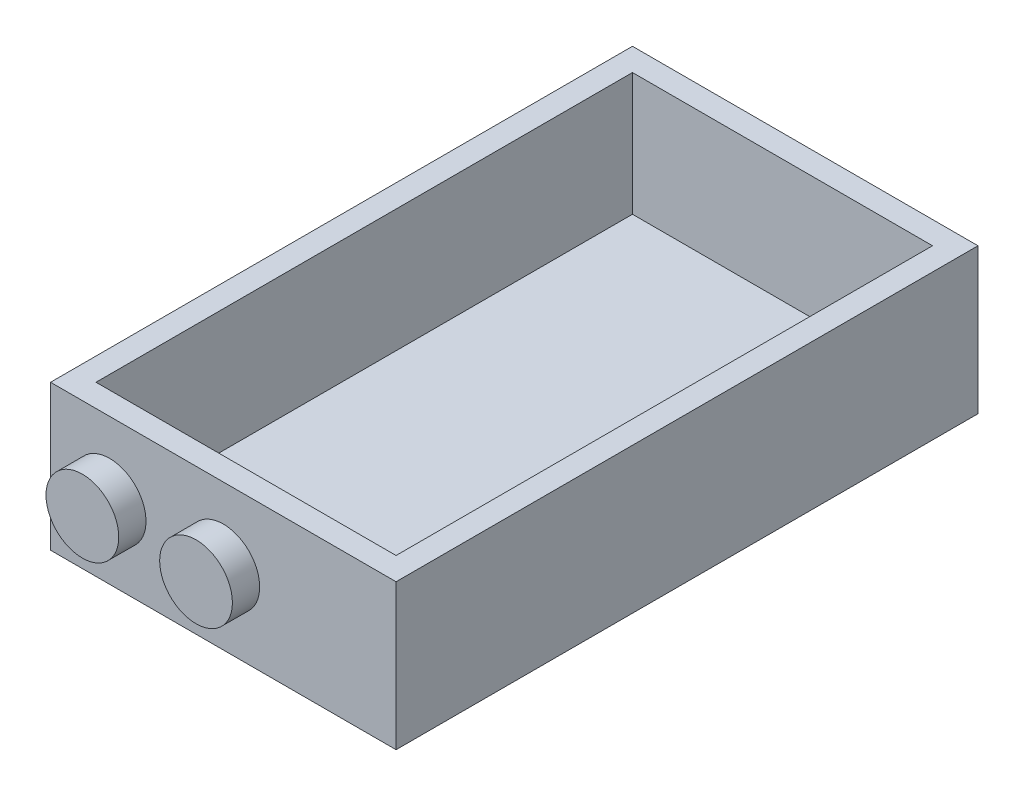
ISO-10303-21;
HEADER;
FILE_DESCRIPTION(('STEP AP214'),'2;1');
FILE_NAME('part.step','',(''),(''),'','','');
FILE_SCHEMA(('AUTOMOTIVE_DESIGN { 1 0 10303 214 1 1 1 1 }'));
ENDSEC;
DATA;
#1=APPLICATION_CONTEXT('core data for automotive mechanical design processes');
#2=APPLICATION_PROTOCOL_DEFINITION('international standard','automotive_design',2000,#1);
#3=PRODUCT_CONTEXT('',#1,'mechanical');
#4=PRODUCT('Part','Part','',(#3));
#5=PRODUCT_RELATED_PRODUCT_CATEGORY('part','',(#4));
#6=PRODUCT_DEFINITION_FORMATION('','',#4);
#7=PRODUCT_DEFINITION_CONTEXT('part definition',#1,'design');
#8=PRODUCT_DEFINITION('design','',#6,#7);
#9=PRODUCT_DEFINITION_SHAPE('','',#8);
#10=(LENGTH_UNIT() NAMED_UNIT(*) SI_UNIT(.MILLI.,.METRE.));
#11=(NAMED_UNIT(*) PLANE_ANGLE_UNIT() SI_UNIT($,.RADIAN.));
#12=(NAMED_UNIT(*) SI_UNIT($,.STERADIAN.) SOLID_ANGLE_UNIT());
#13=UNCERTAINTY_MEASURE_WITH_UNIT(LENGTH_MEASURE(1.E-05),#10,'distance_accuracy_value','');
#14=(GEOMETRIC_REPRESENTATION_CONTEXT(3) GLOBAL_UNCERTAINTY_ASSIGNED_CONTEXT((#13)) GLOBAL_UNIT_ASSIGNED_CONTEXT((#10,
#11,#12)) REPRESENTATION_CONTEXT('',''));
#15=CARTESIAN_POINT('',(0.,0.,0.));
#16=DIRECTION('',(0.,0.,1.));
#17=DIRECTION('',(1.,0.,0.));
#18=AXIS2_PLACEMENT_3D('',#15,#16,#17);
#19=CARTESIAN_POINT('',(0.,16.,0.));
#20=DIRECTION('',(1.,0.,0.));
#21=DIRECTION('',(0.,0.,-1.));
#22=AXIS2_PLACEMENT_3D('',#19,#20,#21);
#23=PLANE('',#22);
#24=DIRECTION('',(0.,0.,1.));
#25=VECTOR('',#24,1.);
#26=CARTESIAN_POINT('',(0.,0.,0.));
#27=LINE('',#26,#25);
#28=CARTESIAN_POINT('',(0.,0.,0.));
#29=VERTEX_POINT('',#28);
#30=CARTESIAN_POINT('',(0.,0.,64.));
#31=VERTEX_POINT('',#30);
#32=EDGE_CURVE('E154',#29,#31,#27,.T.);
#33=ORIENTED_EDGE('',*,*,#32,.T.);
#34=DIRECTION('',(0.,-1.,0.));
#35=VECTOR('',#34,1.);
#36=CARTESIAN_POINT('',(0.,16.,64.));
#37=LINE('',#36,#35);
#38=CARTESIAN_POINT('',(0.,16.,64.));
#39=VERTEX_POINT('',#38);
#40=EDGE_CURVE('E175',#39,#31,#37,.T.);
#41=ORIENTED_EDGE('',*,*,#40,.F.);
#42=DIRECTION('',(0.,0.,1.));
#43=VECTOR('',#42,1.);
#44=CARTESIAN_POINT('',(0.,16.,0.));
#45=LINE('',#44,#43);
#46=CARTESIAN_POINT('',(0.,16.,0.));
#47=VERTEX_POINT('',#46);
#48=EDGE_CURVE('E155',#47,#39,#45,.T.);
#49=ORIENTED_EDGE('',*,*,#48,.F.);
#50=DIRECTION('',(0.,-1.,0.));
#51=VECTOR('',#50,1.);
#52=CARTESIAN_POINT('',(0.,16.,0.));
#53=LINE('',#52,#51);
#54=EDGE_CURVE('E161',#47,#29,#53,.T.);
#55=ORIENTED_EDGE('',*,*,#54,.T.);
#56=EDGE_LOOP('',(#33,#41,#49,#55));
#57=FACE_BOUND('',#56,.T.);
#58=ADVANCED_FACE('F33',(#57),#23,.F.);
#59=CARTESIAN_POINT('',(0.,16.,64.));
#60=DIRECTION('',(0.,0.,-1.));
#61=DIRECTION('',(-1.,0.,0.));
#62=AXIS2_PLACEMENT_3D('',#59,#60,#61);
#63=PLANE('',#62);
#64=CARTESIAN_POINT('',(6.50000000000002,8.,64.));
#65=DIRECTION('',(0.,0.,-1.));
#66=DIRECTION('',(-1.,0.,0.));
#67=AXIS2_PLACEMENT_3D('',#64,#65,#66);
#68=CIRCLE('',#67,4.);
#69=CARTESIAN_POINT('',(2.50000000000002,8.,64.));
#70=VERTEX_POINT('',#69);
#71=EDGE_CURVE('E11',#70,#70,#68,.F.);
#72=ORIENTED_EDGE('',*,*,#71,.F.);
#73=EDGE_LOOP('',(#72));
#74=FACE_BOUND('',#73,.T.);
#75=CARTESIAN_POINT('',(19.,8.,64.));
#76=DIRECTION('',(0.,0.,-1.));
#77=DIRECTION('',(-1.,0.,0.));
#78=AXIS2_PLACEMENT_3D('',#75,#76,#77);
#79=CIRCLE('',#78,4.);
#80=CARTESIAN_POINT('',(15.,8.,64.));
#81=VERTEX_POINT('',#80);
#82=EDGE_CURVE('E40',#81,#81,#79,.F.);
#83=ORIENTED_EDGE('',*,*,#82,.F.);
#84=EDGE_LOOP('',(#83));
#85=FACE_BOUND('',#84,.T.);
#86=DIRECTION('',(1.,0.,0.));
#87=VECTOR('',#86,1.);
#88=CARTESIAN_POINT('',(0.,0.,64.));
#89=LINE('',#88,#87);
#90=CARTESIAN_POINT('',(38.,0.,64.));
#91=VERTEX_POINT('',#90);
#92=EDGE_CURVE('E164',#31,#91,#89,.T.);
#93=ORIENTED_EDGE('',*,*,#92,.T.);
#94=DIRECTION('',(0.,-1.,0.));
#95=VECTOR('',#94,1.);
#96=CARTESIAN_POINT('',(38.,16.,64.));
#97=LINE('',#96,#95);
#98=CARTESIAN_POINT('',(38.,16.,64.));
#99=VERTEX_POINT('',#98);
#100=EDGE_CURVE('E172',#99,#91,#97,.T.);
#101=ORIENTED_EDGE('',*,*,#100,.F.);
#102=DIRECTION('',(1.,0.,0.));
#103=VECTOR('',#102,1.);
#104=CARTESIAN_POINT('',(0.,16.,64.));
#105=LINE('',#104,#103);
#106=EDGE_CURVE('E85',#39,#99,#105,.T.);
#107=ORIENTED_EDGE('',*,*,#106,.F.);
#108=ORIENTED_EDGE('',*,*,#40,.T.);
#109=EDGE_LOOP('',(#93,#101,#107,#108));
#110=FACE_BOUND('',#109,.T.);
#111=ADVANCED_FACE('F181',(#74,#85,#110),#63,.F.);
#112=CARTESIAN_POINT('',(38.,16.,0.));
#113=DIRECTION('',(-1.,0.,0.));
#114=DIRECTION('',(0.,0.,1.));
#115=AXIS2_PLACEMENT_3D('',#112,#113,#114);
#116=PLANE('',#115);
#117=DIRECTION('',(0.,0.,-1.));
#118=VECTOR('',#117,1.);
#119=CARTESIAN_POINT('',(38.,0.,0.));
#120=LINE('',#119,#118);
#121=CARTESIAN_POINT('',(38.,0.,0.));
#122=VERTEX_POINT('',#121);
#123=EDGE_CURVE('E166',#91,#122,#120,.T.);
#124=ORIENTED_EDGE('',*,*,#123,.T.);
#125=DIRECTION('',(0.,-1.,0.));
#126=VECTOR('',#125,1.);
#127=CARTESIAN_POINT('',(38.,16.,0.));
#128=LINE('',#127,#126);
#129=CARTESIAN_POINT('',(38.,16.,0.));
#130=VERTEX_POINT('',#129);
#131=EDGE_CURVE('E170',#130,#122,#128,.T.);
#132=ORIENTED_EDGE('',*,*,#131,.F.);
#133=DIRECTION('',(0.,0.,-1.));
#134=VECTOR('',#133,1.);
#135=CARTESIAN_POINT('',(38.,16.,0.));
#136=LINE('',#135,#134);
#137=EDGE_CURVE('E158',#99,#130,#136,.T.);
#138=ORIENTED_EDGE('',*,*,#137,.F.);
#139=ORIENTED_EDGE('',*,*,#100,.T.);
#140=EDGE_LOOP('',(#124,#132,#138,#139));
#141=FACE_BOUND('',#140,.T.);
#142=ADVANCED_FACE('F183',(#141),#116,.F.);
#143=CARTESIAN_POINT('',(0.,16.,0.));
#144=DIRECTION('',(0.,0.,1.));
#145=DIRECTION('',(1.,0.,0.));
#146=AXIS2_PLACEMENT_3D('',#143,#144,#145);
#147=PLANE('',#146);
#148=DIRECTION('',(-1.,0.,0.));
#149=VECTOR('',#148,1.);
#150=CARTESIAN_POINT('',(0.,0.,0.));
#151=LINE('',#150,#149);
#152=EDGE_CURVE('E77',#122,#29,#151,.T.);
#153=ORIENTED_EDGE('',*,*,#152,.T.);
#154=ORIENTED_EDGE('',*,*,#54,.F.);
#155=DIRECTION('',(-1.,0.,0.));
#156=VECTOR('',#155,1.);
#157=CARTESIAN_POINT('',(0.,16.,0.));
#158=LINE('',#157,#156);
#159=EDGE_CURVE('E56',#130,#47,#158,.T.);
#160=ORIENTED_EDGE('',*,*,#159,.F.);
#161=ORIENTED_EDGE('',*,*,#131,.T.);
#162=EDGE_LOOP('',(#153,#154,#160,#161));
#163=FACE_BOUND('',#162,.T.);
#164=ADVANCED_FACE('F195',(#163),#147,.F.);
#165=CARTESIAN_POINT('',(0.,16.,0.));
#166=DIRECTION('',(0.,1.,0.));
#167=DIRECTION('',(0.,0.,1.));
#168=AXIS2_PLACEMENT_3D('',#165,#166,#167);
#169=PLANE('',#168);
#170=DIRECTION('',(0.,0.,1.));
#171=VECTOR('',#170,1.);
#172=CARTESIAN_POINT('',(2.5,16.,0.));
#173=LINE('',#172,#171);
#174=CARTESIAN_POINT('',(2.5,16.,2.5));
#175=VERTEX_POINT('',#174);
#176=CARTESIAN_POINT('',(2.50000000000002,16.,61.5));
#177=VERTEX_POINT('',#176);
#178=EDGE_CURVE('E130',#175,#177,#173,.T.);
#179=ORIENTED_EDGE('',*,*,#178,.F.);
#180=DIRECTION('',(-1.,0.,0.));
#181=VECTOR('',#180,1.);
#182=CARTESIAN_POINT('',(0.,16.,2.5));
#183=LINE('',#182,#181);
#184=CARTESIAN_POINT('',(35.5,16.,2.5));
#185=VERTEX_POINT('',#184);
#186=EDGE_CURVE('E145',#185,#175,#183,.T.);
#187=ORIENTED_EDGE('',*,*,#186,.F.);
#188=DIRECTION('',(0.,0.,-1.));
#189=VECTOR('',#188,1.);
#190=CARTESIAN_POINT('',(35.5,16.,0.));
#191=LINE('',#190,#189);
#192=CARTESIAN_POINT('',(35.5,16.,61.5));
#193=VERTEX_POINT('',#192);
#194=EDGE_CURVE('E143',#193,#185,#191,.T.);
#195=ORIENTED_EDGE('',*,*,#194,.F.);
#196=DIRECTION('',(1.,0.,0.));
#197=VECTOR('',#196,1.);
#198=CARTESIAN_POINT('',(0.,16.,61.5));
#199=LINE('',#198,#197);
#200=EDGE_CURVE('E122',#177,#193,#199,.T.);
#201=ORIENTED_EDGE('',*,*,#200,.F.);
#202=EDGE_LOOP('',(#179,#187,#195,#201));
#203=FACE_BOUND('',#202,.T.);
#204=ORIENTED_EDGE('',*,*,#48,.T.);
#205=ORIENTED_EDGE('',*,*,#106,.T.);
#206=ORIENTED_EDGE('',*,*,#137,.T.);
#207=ORIENTED_EDGE('',*,*,#159,.T.);
#208=EDGE_LOOP('',(#204,#205,#206,#207));
#209=FACE_BOUND('',#208,.T.);
#210=ADVANCED_FACE('F197',(#203,#209),#169,.T.);
#211=CARTESIAN_POINT('',(0.,0.,0.));
#212=DIRECTION('',(0.,1.,0.));
#213=DIRECTION('',(0.,0.,1.));
#214=AXIS2_PLACEMENT_3D('',#211,#212,#213);
#215=PLANE('',#214);
#216=ORIENTED_EDGE('',*,*,#32,.F.);
#217=ORIENTED_EDGE('',*,*,#152,.F.);
#218=ORIENTED_EDGE('',*,*,#123,.F.);
#219=ORIENTED_EDGE('',*,*,#92,.F.);
#220=EDGE_LOOP('',(#216,#217,#218,#219));
#221=FACE_BOUND('',#220,.T.);
#222=ADVANCED_FACE('F192',(#221),#215,.F.);
#223=CARTESIAN_POINT('',(19.,8.,67.));
#224=DIRECTION('',(0.,0.,-1.));
#225=DIRECTION('',(-1.,0.,0.));
#226=AXIS2_PLACEMENT_3D('',#223,#224,#225);
#227=CYLINDRICAL_SURFACE('',#226,4.);
#228=CARTESIAN_POINT('',(19.,8.,67.));
#229=DIRECTION('',(0.,0.,1.));
#230=DIRECTION('',(1.,0.,0.));
#231=AXIS2_PLACEMENT_3D('',#228,#229,#230);
#232=CIRCLE('',#231,4.);
#233=CARTESIAN_POINT('',(23.,8.,67.));
#234=VERTEX_POINT('',#233);
#235=EDGE_CURVE('E150',#234,#234,#232,.T.);
#236=ORIENTED_EDGE('',*,*,#235,.F.);
#237=EDGE_LOOP('',(#236));
#238=FACE_BOUND('',#237,.T.);
#239=ORIENTED_EDGE('',*,*,#82,.T.);
#240=EDGE_LOOP('',(#239));
#241=FACE_BOUND('',#240,.T.);
#242=ADVANCED_FACE('F179',(#238,#241),#227,.T.);
#243=CARTESIAN_POINT('',(19.,8.,67.));
#244=DIRECTION('',(0.,0.,1.));
#245=DIRECTION('',(1.,0.,0.));
#246=AXIS2_PLACEMENT_3D('',#243,#244,#245);
#247=PLANE('',#246);
#248=ORIENTED_EDGE('',*,*,#235,.T.);
#249=EDGE_LOOP('',(#248));
#250=FACE_BOUND('',#249,.T.);
#251=ADVANCED_FACE('F241',(#250),#247,.T.);
#252=CARTESIAN_POINT('',(6.50000000000002,8.,67.));
#253=DIRECTION('',(0.,0.,-1.));
#254=DIRECTION('',(-1.,0.,0.));
#255=AXIS2_PLACEMENT_3D('',#252,#253,#254);
#256=CYLINDRICAL_SURFACE('',#255,4.);
#257=CARTESIAN_POINT('',(6.50000000000002,8.,67.));
#258=DIRECTION('',(0.,0.,1.));
#259=DIRECTION('',(1.,0.,0.));
#260=AXIS2_PLACEMENT_3D('',#257,#258,#259);
#261=CIRCLE('',#260,4.);
#262=CARTESIAN_POINT('',(10.5,8.,67.));
#263=VERTEX_POINT('',#262);
#264=EDGE_CURVE('E147',#263,#263,#261,.T.);
#265=ORIENTED_EDGE('',*,*,#264,.F.);
#266=EDGE_LOOP('',(#265));
#267=FACE_BOUND('',#266,.T.);
#268=ORIENTED_EDGE('',*,*,#71,.T.);
#269=EDGE_LOOP('',(#268));
#270=FACE_BOUND('',#269,.T.);
#271=ADVANCED_FACE('F248',(#267,#270),#256,.T.);
#272=CARTESIAN_POINT('',(6.50000000000002,8.,67.));
#273=DIRECTION('',(0.,0.,1.));
#274=DIRECTION('',(1.,0.,0.));
#275=AXIS2_PLACEMENT_3D('',#272,#273,#274);
#276=PLANE('',#275);
#277=ORIENTED_EDGE('',*,*,#264,.T.);
#278=EDGE_LOOP('',(#277));
#279=FACE_BOUND('',#278,.T.);
#280=ADVANCED_FACE('F256',(#279),#276,.T.);
#281=CARTESIAN_POINT('',(2.5,16.,0.));
#282=DIRECTION('',(1.,0.,0.));
#283=DIRECTION('',(0.,0.,-1.));
#284=AXIS2_PLACEMENT_3D('',#281,#282,#283);
#285=PLANE('',#284);
#286=DIRECTION('',(0.,0.,1.));
#287=VECTOR('',#286,1.);
#288=CARTESIAN_POINT('',(2.5,2.5,0.));
#289=LINE('',#288,#287);
#290=CARTESIAN_POINT('',(2.5,2.5,2.5));
#291=VERTEX_POINT('',#290);
#292=CARTESIAN_POINT('',(2.50000000000002,2.5,61.5));
#293=VERTEX_POINT('',#292);
#294=EDGE_CURVE('E113',#291,#293,#289,.T.);
#295=ORIENTED_EDGE('',*,*,#294,.F.);
#296=DIRECTION('',(0.,-1.,0.));
#297=VECTOR('',#296,1.);
#298=CARTESIAN_POINT('',(2.5,16.,2.5));
#299=LINE('',#298,#297);
#300=EDGE_CURVE('E133',#175,#291,#299,.T.);
#301=ORIENTED_EDGE('',*,*,#300,.F.);
#302=ORIENTED_EDGE('',*,*,#178,.T.);
#303=DIRECTION('',(0.,-1.,0.));
#304=VECTOR('',#303,1.);
#305=CARTESIAN_POINT('',(2.50000000000002,16.,61.5));
#306=LINE('',#305,#304);
#307=EDGE_CURVE('E125',#177,#293,#306,.T.);
#308=ORIENTED_EDGE('',*,*,#307,.T.);
#309=EDGE_LOOP('',(#295,#301,#302,#308));
#310=FACE_BOUND('',#309,.T.);
#311=ADVANCED_FACE('F264',(#310),#285,.T.);
#312=CARTESIAN_POINT('',(0.,16.,61.5));
#313=DIRECTION('',(0.,0.,-1.));
#314=DIRECTION('',(-1.,0.,0.));
#315=AXIS2_PLACEMENT_3D('',#312,#313,#314);
#316=PLANE('',#315);
#317=CARTESIAN_POINT('',(6.50000000000002,8.,61.5));
#318=DIRECTION('',(0.,0.,-1.));
#319=DIRECTION('',(-1.,0.,0.));
#320=AXIS2_PLACEMENT_3D('',#317,#318,#319);
#321=CIRCLE('',#320,1.5);
#322=CARTESIAN_POINT('',(5.00000000000002,8.,61.5));
#323=VERTEX_POINT('',#322);
#324=EDGE_CURVE('E151',#323,#323,#321,.F.);
#325=ORIENTED_EDGE('',*,*,#324,.T.);
#326=EDGE_LOOP('',(#325));
#327=FACE_BOUND('',#326,.T.);
#328=CARTESIAN_POINT('',(19.,8.,61.5));
#329=DIRECTION('',(0.,0.,-1.));
#330=DIRECTION('',(-1.,0.,0.));
#331=AXIS2_PLACEMENT_3D('',#328,#329,#330);
#332=CIRCLE('',#331,1.5);
#333=CARTESIAN_POINT('',(17.5,8.,61.5));
#334=VERTEX_POINT('',#333);
#335=EDGE_CURVE('E363',#334,#334,#332,.F.);
#336=ORIENTED_EDGE('',*,*,#335,.T.);
#337=EDGE_LOOP('',(#336));
#338=FACE_BOUND('',#337,.T.);
#339=DIRECTION('',(1.,0.,0.));
#340=VECTOR('',#339,1.);
#341=CARTESIAN_POINT('',(0.,2.5,61.5));
#342=LINE('',#341,#340);
#343=CARTESIAN_POINT('',(35.5,2.5,61.5));
#344=VERTEX_POINT('',#343);
#345=EDGE_CURVE('E107',#293,#344,#342,.T.);
#346=ORIENTED_EDGE('',*,*,#345,.F.);
#347=ORIENTED_EDGE('',*,*,#307,.F.);
#348=ORIENTED_EDGE('',*,*,#200,.T.);
#349=DIRECTION('',(0.,-1.,0.));
#350=VECTOR('',#349,1.);
#351=CARTESIAN_POINT('',(35.5,16.,61.5));
#352=LINE('',#351,#350);
#353=EDGE_CURVE('E119',#193,#344,#352,.T.);
#354=ORIENTED_EDGE('',*,*,#353,.T.);
#355=EDGE_LOOP('',(#346,#347,#348,#354));
#356=FACE_BOUND('',#355,.T.);
#357=ADVANCED_FACE('F120',(#327,#338,#356),#316,.T.);
#358=CARTESIAN_POINT('',(35.5,16.,0.));
#359=DIRECTION('',(-1.,0.,0.));
#360=DIRECTION('',(0.,0.,1.));
#361=AXIS2_PLACEMENT_3D('',#358,#359,#360);
#362=PLANE('',#361);
#363=DIRECTION('',(0.,0.,-1.));
#364=VECTOR('',#363,1.);
#365=CARTESIAN_POINT('',(35.5,2.5,0.));
#366=LINE('',#365,#364);
#367=CARTESIAN_POINT('',(35.5,2.5,2.5));
#368=VERTEX_POINT('',#367);
#369=EDGE_CURVE('E111',#344,#368,#366,.T.);
#370=ORIENTED_EDGE('',*,*,#369,.F.);
#371=ORIENTED_EDGE('',*,*,#353,.F.);
#372=ORIENTED_EDGE('',*,*,#194,.T.);
#373=DIRECTION('',(0.,-1.,0.));
#374=VECTOR('',#373,1.);
#375=CARTESIAN_POINT('',(35.5,16.,2.5));
#376=LINE('',#375,#374);
#377=EDGE_CURVE('E47',#185,#368,#376,.T.);
#378=ORIENTED_EDGE('',*,*,#377,.T.);
#379=EDGE_LOOP('',(#370,#371,#372,#378));
#380=FACE_BOUND('',#379,.T.);
#381=ADVANCED_FACE('F127',(#380),#362,.T.);
#382=CARTESIAN_POINT('',(0.,16.,2.5));
#383=DIRECTION('',(0.,0.,1.));
#384=DIRECTION('',(1.,0.,0.));
#385=AXIS2_PLACEMENT_3D('',#382,#383,#384);
#386=PLANE('',#385);
#387=DIRECTION('',(-1.,0.,0.));
#388=VECTOR('',#387,1.);
#389=CARTESIAN_POINT('',(0.,2.5,2.5));
#390=LINE('',#389,#388);
#391=EDGE_CURVE('E128',#368,#291,#390,.T.);
#392=ORIENTED_EDGE('',*,*,#391,.F.);
#393=ORIENTED_EDGE('',*,*,#377,.F.);
#394=ORIENTED_EDGE('',*,*,#186,.T.);
#395=ORIENTED_EDGE('',*,*,#300,.T.);
#396=EDGE_LOOP('',(#392,#393,#394,#395));
#397=FACE_BOUND('',#396,.T.);
#398=ADVANCED_FACE('F286',(#397),#386,.T.);
#399=CARTESIAN_POINT('',(0.,2.5,0.));
#400=DIRECTION('',(0.,1.,0.));
#401=DIRECTION('',(0.,0.,1.));
#402=AXIS2_PLACEMENT_3D('',#399,#400,#401);
#403=PLANE('',#402);
#404=ORIENTED_EDGE('',*,*,#294,.T.);
#405=ORIENTED_EDGE('',*,*,#345,.T.);
#406=ORIENTED_EDGE('',*,*,#369,.T.);
#407=ORIENTED_EDGE('',*,*,#391,.T.);
#408=EDGE_LOOP('',(#404,#405,#406,#407));
#409=FACE_BOUND('',#408,.T.);
#410=ADVANCED_FACE('F109',(#409),#403,.T.);
#411=CARTESIAN_POINT('',(19.,8.,67.));
#412=DIRECTION('',(0.,0.,-1.));
#413=DIRECTION('',(-1.,0.,0.));
#414=AXIS2_PLACEMENT_3D('',#411,#412,#413);
#415=CYLINDRICAL_SURFACE('',#414,1.5);
#416=CARTESIAN_POINT('',(19.,8.,64.5));
#417=DIRECTION('',(0.,0.,1.));
#418=DIRECTION('',(1.,0.,0.));
#419=AXIS2_PLACEMENT_3D('',#416,#417,#418);
#420=CIRCLE('',#419,1.5);
#421=CARTESIAN_POINT('',(20.5,8.,64.5));
#422=VERTEX_POINT('',#421);
#423=EDGE_CURVE('E135',#422,#422,#420,.T.);
#424=ORIENTED_EDGE('',*,*,#423,.T.);
#425=EDGE_LOOP('',(#424));
#426=FACE_BOUND('',#425,.T.);
#427=ORIENTED_EDGE('',*,*,#335,.F.);
#428=EDGE_LOOP('',(#427));
#429=FACE_BOUND('',#428,.T.);
#430=ADVANCED_FACE('F299',(#426,#429),#415,.F.);
#431=CARTESIAN_POINT('',(19.,8.,64.5));
#432=DIRECTION('',(0.,0.,1.));
#433=DIRECTION('',(1.,0.,0.));
#434=AXIS2_PLACEMENT_3D('',#431,#432,#433);
#435=PLANE('',#434);
#436=ORIENTED_EDGE('',*,*,#423,.F.);
#437=EDGE_LOOP('',(#436));
#438=FACE_BOUND('',#437,.T.);
#439=ADVANCED_FACE('F306',(#438),#435,.F.);
#440=CARTESIAN_POINT('',(6.50000000000002,8.,67.));
#441=DIRECTION('',(0.,0.,-1.));
#442=DIRECTION('',(-1.,0.,0.));
#443=AXIS2_PLACEMENT_3D('',#440,#441,#442);
#444=CYLINDRICAL_SURFACE('',#443,1.5);
#445=CARTESIAN_POINT('',(6.50000000000002,8.,64.5));
#446=DIRECTION('',(0.,0.,1.));
#447=DIRECTION('',(1.,0.,0.));
#448=AXIS2_PLACEMENT_3D('',#445,#446,#447);
#449=CIRCLE('',#448,1.5);
#450=CARTESIAN_POINT('',(8.00000000000002,8.,64.5));
#451=VERTEX_POINT('',#450);
#452=EDGE_CURVE('E138',#451,#451,#449,.T.);
#453=ORIENTED_EDGE('',*,*,#452,.T.);
#454=EDGE_LOOP('',(#453));
#455=FACE_BOUND('',#454,.T.);
#456=ORIENTED_EDGE('',*,*,#324,.F.);
#457=EDGE_LOOP('',(#456));
#458=FACE_BOUND('',#457,.T.);
#459=ADVANCED_FACE('F314',(#455,#458),#444,.F.);
#460=CARTESIAN_POINT('',(6.50000000000002,8.,64.5));
#461=DIRECTION('',(0.,0.,1.));
#462=DIRECTION('',(1.,0.,0.));
#463=AXIS2_PLACEMENT_3D('',#460,#461,#462);
#464=PLANE('',#463);
#465=ORIENTED_EDGE('',*,*,#452,.F.);
#466=EDGE_LOOP('',(#465));
#467=FACE_BOUND('',#466,.T.);
#468=ADVANCED_FACE('F322',(#467),#464,.F.);
#469=CLOSED_SHELL('',(#58,#111,#142,#164,#210,#222,#242,#251,#271,#280,#311,#357,#381,#398,#410,
#430,#439,#459,#468));
#470=MANIFOLD_SOLID_BREP('B2',#469);
#471=ADVANCED_BREP_SHAPE_REPRESENTATION('',(#18,#470),#14);
#472=SHAPE_DEFINITION_REPRESENTATION(#9,#471);
ENDSEC;
END-ISO-10303-21;
